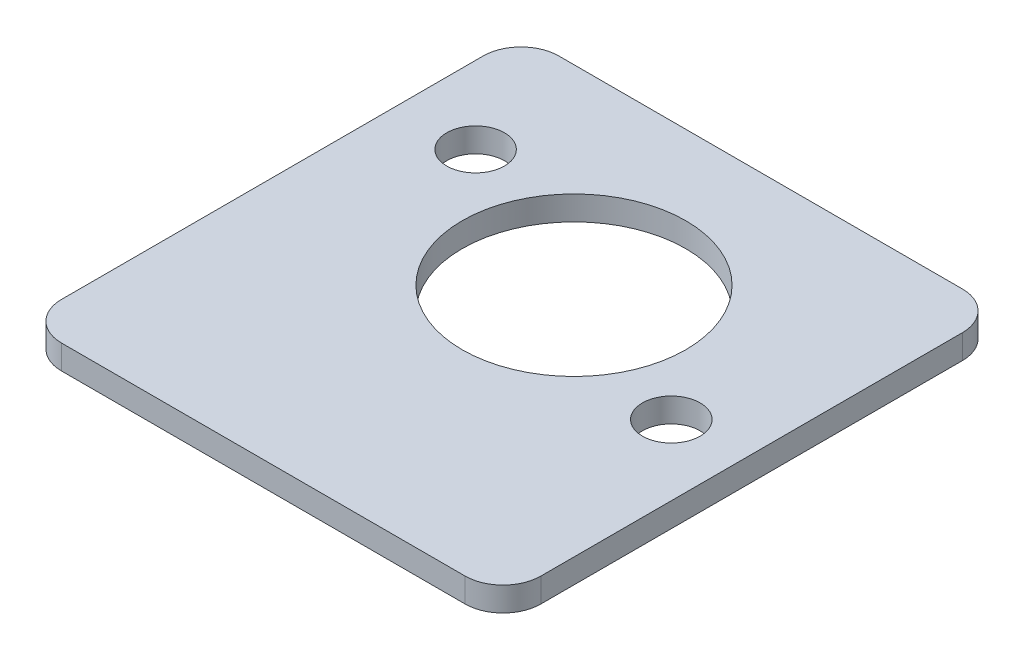
ISO-10303-21;
HEADER;
FILE_DESCRIPTION(('STEP AP214'),'2;1');
FILE_NAME('part.step','',(''),(''),'','','');
FILE_SCHEMA(('AUTOMOTIVE_DESIGN { 1 0 10303 214 1 1 1 1 }'));
ENDSEC;
DATA;
#1=APPLICATION_CONTEXT('core data for automotive mechanical design processes');
#2=APPLICATION_PROTOCOL_DEFINITION('international standard','automotive_design',2000,#1);
#3=PRODUCT_CONTEXT('',#1,'mechanical');
#4=PRODUCT('Part','Part','',(#3));
#5=PRODUCT_RELATED_PRODUCT_CATEGORY('part','',(#4));
#6=PRODUCT_DEFINITION_FORMATION('','',#4);
#7=PRODUCT_DEFINITION_CONTEXT('part definition',#1,'design');
#8=PRODUCT_DEFINITION('design','',#6,#7);
#9=PRODUCT_DEFINITION_SHAPE('','',#8);
#10=(LENGTH_UNIT() NAMED_UNIT(*) SI_UNIT(.MILLI.,.METRE.));
#11=(NAMED_UNIT(*) PLANE_ANGLE_UNIT() SI_UNIT($,.RADIAN.));
#12=(NAMED_UNIT(*) SI_UNIT($,.STERADIAN.) SOLID_ANGLE_UNIT());
#13=UNCERTAINTY_MEASURE_WITH_UNIT(LENGTH_MEASURE(1.E-05),#10,'distance_accuracy_value','');
#14=(GEOMETRIC_REPRESENTATION_CONTEXT(3) GLOBAL_UNCERTAINTY_ASSIGNED_CONTEXT((#13)) GLOBAL_UNIT_ASSIGNED_CONTEXT((#10,
#11,#12)) REPRESENTATION_CONTEXT('',''));
#15=CARTESIAN_POINT('',(0.,0.,0.));
#16=DIRECTION('',(0.,0.,1.));
#17=DIRECTION('',(1.,0.,0.));
#18=AXIS2_PLACEMENT_3D('',#15,#16,#17);
#19=CARTESIAN_POINT('',(0.,3.2,0.));
#20=DIRECTION('',(0.,1.,0.));
#21=DIRECTION('',(0.,0.,1.));
#22=AXIS2_PLACEMENT_3D('',#19,#20,#21);
#23=PLANE('',#22);
#24=CARTESIAN_POINT('',(-21.47,3.2,-16.66));
#25=DIRECTION('',(0.,1.,0.));
#26=DIRECTION('',(0.,0.,1.));
#27=AXIS2_PLACEMENT_3D('',#24,#25,#26);
#28=CIRCLE('',#27,3.81);
#29=CARTESIAN_POINT('',(-21.47,3.2,-12.85));
#30=VERTEX_POINT('',#29);
#31=EDGE_CURVE('E183',#30,#30,#28,.T.);
#32=ORIENTED_EDGE('',*,*,#31,.F.);
#33=EDGE_LOOP('',(#32));
#34=FACE_BOUND('',#33,.T.);
#35=CARTESIAN_POINT('',(0.569999999999994,3.2,-7.62000000000002));
#36=DIRECTION('',(0.,1.,0.));
#37=DIRECTION('',(0.,0.,1.));
#38=AXIS2_PLACEMENT_3D('',#35,#36,#37);
#39=CIRCLE('',#38,14.77);
#40=CARTESIAN_POINT('',(0.569999999999994,3.2,7.14999999999999));
#41=VERTEX_POINT('',#40);
#42=EDGE_CURVE('E138',#41,#41,#39,.T.);
#43=ORIENTED_EDGE('',*,*,#42,.F.);
#44=EDGE_LOOP('',(#43));
#45=FACE_BOUND('',#44,.T.);
#46=CARTESIAN_POINT('',(22.3659216527605,3.2,1.31988801002514));
#47=DIRECTION('',(0.,1.,0.));
#48=DIRECTION('',(0.,0.,1.));
#49=AXIS2_PLACEMENT_3D('',#46,#47,#48);
#50=CIRCLE('',#49,3.81);
#51=CARTESIAN_POINT('',(22.3659216527605,3.2,5.12988801002514));
#52=VERTEX_POINT('',#51);
#53=EDGE_CURVE('E176',#52,#52,#50,.T.);
#54=ORIENTED_EDGE('',*,*,#53,.F.);
#55=EDGE_LOOP('',(#54));
#56=FACE_BOUND('',#55,.T.);
#57=DIRECTION('',(-1.,0.,0.));
#58=VECTOR('',#57,1.);
#59=CARTESIAN_POINT('',(31.66,3.2,-32.85));
#60=LINE('',#59,#58);
#61=CARTESIAN_POINT('',(26.66,3.2,-32.85));
#62=VERTEX_POINT('',#61);
#63=CARTESIAN_POINT('',(-26.66,3.2,-32.85));
#64=VERTEX_POINT('',#63);
#65=EDGE_CURVE('E12',#62,#64,#60,.T.);
#66=ORIENTED_EDGE('',*,*,#65,.T.);
#67=CARTESIAN_POINT('',(-26.66,3.2,-27.85));
#68=DIRECTION('',(0.,1.,0.));
#69=DIRECTION('',(0.,0.,1.));
#70=AXIS2_PLACEMENT_3D('',#67,#68,#69);
#71=CIRCLE('',#70,5.);
#72=CARTESIAN_POINT('',(-31.66,3.2,-27.85));
#73=VERTEX_POINT('',#72);
#74=EDGE_CURVE('E102',#64,#73,#71,.T.);
#75=ORIENTED_EDGE('',*,*,#74,.T.);
#76=DIRECTION('',(0.,0.,1.));
#77=VECTOR('',#76,1.);
#78=CARTESIAN_POINT('',(-31.66,3.2,32.85));
#79=LINE('',#78,#77);
#80=CARTESIAN_POINT('',(-31.66,3.2,27.85));
#81=VERTEX_POINT('',#80);
#82=EDGE_CURVE('E116',#73,#81,#79,.T.);
#83=ORIENTED_EDGE('',*,*,#82,.T.);
#84=CARTESIAN_POINT('',(-26.66,3.2,27.85));
#85=DIRECTION('',(0.,1.,0.));
#86=DIRECTION('',(0.,0.,-1.));
#87=AXIS2_PLACEMENT_3D('',#84,#85,#86);
#88=CIRCLE('',#87,5.);
#89=CARTESIAN_POINT('',(-26.66,3.2,32.85));
#90=VERTEX_POINT('',#89);
#91=EDGE_CURVE('E119',#81,#90,#88,.T.);
#92=ORIENTED_EDGE('',*,*,#91,.T.);
#93=DIRECTION('',(1.,0.,0.));
#94=VECTOR('',#93,1.);
#95=CARTESIAN_POINT('',(31.66,3.2,32.85));
#96=LINE('',#95,#94);
#97=CARTESIAN_POINT('',(26.66,3.2,32.85));
#98=VERTEX_POINT('',#97);
#99=EDGE_CURVE('E123',#90,#98,#96,.T.);
#100=ORIENTED_EDGE('',*,*,#99,.T.);
#101=CARTESIAN_POINT('',(26.66,3.2,27.85));
#102=DIRECTION('',(0.,1.,0.));
#103=DIRECTION('',(0.,0.,1.));
#104=AXIS2_PLACEMENT_3D('',#101,#102,#103);
#105=CIRCLE('',#104,5.);
#106=CARTESIAN_POINT('',(31.66,3.2,27.85));
#107=VERTEX_POINT('',#106);
#108=EDGE_CURVE('E163',#98,#107,#105,.T.);
#109=ORIENTED_EDGE('',*,*,#108,.T.);
#110=DIRECTION('',(0.,0.,-1.));
#111=VECTOR('',#110,1.);
#112=CARTESIAN_POINT('',(31.66,3.2,32.85));
#113=LINE('',#112,#111);
#114=CARTESIAN_POINT('',(31.66,3.2,-27.85));
#115=VERTEX_POINT('',#114);
#116=EDGE_CURVE('E42',#107,#115,#113,.T.);
#117=ORIENTED_EDGE('',*,*,#116,.T.);
#118=CARTESIAN_POINT('',(26.66,3.2,-27.85));
#119=DIRECTION('',(0.,1.,0.));
#120=DIRECTION('',(0.,0.,1.));
#121=AXIS2_PLACEMENT_3D('',#118,#119,#120);
#122=CIRCLE('',#121,5.);
#123=EDGE_CURVE('E120',#115,#62,#122,.T.);
#124=ORIENTED_EDGE('',*,*,#123,.T.);
#125=EDGE_LOOP('',(#66,#75,#83,#92,#100,#109,#117,#124));
#126=FACE_BOUND('',#125,.T.);
#127=ADVANCED_FACE('F33',(#34,#45,#56,#126),#23,.T.);
#128=CARTESIAN_POINT('',(0.,0.,0.));
#129=DIRECTION('',(0.,1.,0.));
#130=DIRECTION('',(0.,0.,1.));
#131=AXIS2_PLACEMENT_3D('',#128,#129,#130);
#132=PLANE('',#131);
#133=CARTESIAN_POINT('',(0.569999999999994,0.,-7.62000000000002));
#134=DIRECTION('',(0.,1.,0.));
#135=DIRECTION('',(0.,0.,1.));
#136=AXIS2_PLACEMENT_3D('',#133,#134,#135);
#137=CIRCLE('',#136,14.77);
#138=CARTESIAN_POINT('',(0.569999999999994,0.,7.14999999999999));
#139=VERTEX_POINT('',#138);
#140=EDGE_CURVE('E130',#139,#139,#137,.T.);
#141=ORIENTED_EDGE('',*,*,#140,.T.);
#142=EDGE_LOOP('',(#141));
#143=FACE_BOUND('',#142,.T.);
#144=CARTESIAN_POINT('',(-21.47,0.,-16.66));
#145=DIRECTION('',(0.,1.,0.));
#146=DIRECTION('',(0.,0.,1.));
#147=AXIS2_PLACEMENT_3D('',#144,#145,#146);
#148=CIRCLE('',#147,3.81);
#149=CARTESIAN_POINT('',(-21.47,0.,-12.85));
#150=VERTEX_POINT('',#149);
#151=EDGE_CURVE('E179',#150,#150,#148,.T.);
#152=ORIENTED_EDGE('',*,*,#151,.T.);
#153=EDGE_LOOP('',(#152));
#154=FACE_BOUND('',#153,.T.);
#155=CARTESIAN_POINT('',(22.3659216527605,0.,1.31988801002514));
#156=DIRECTION('',(0.,1.,0.));
#157=DIRECTION('',(0.,0.,1.));
#158=AXIS2_PLACEMENT_3D('',#155,#156,#157);
#159=CIRCLE('',#158,3.81);
#160=CARTESIAN_POINT('',(22.3659216527605,0.,5.12988801002514));
#161=VERTEX_POINT('',#160);
#162=EDGE_CURVE('E180',#161,#161,#159,.T.);
#163=ORIENTED_EDGE('',*,*,#162,.T.);
#164=EDGE_LOOP('',(#163));
#165=FACE_BOUND('',#164,.T.);
#166=CARTESIAN_POINT('',(-26.66,0.,-27.85));
#167=DIRECTION('',(0.,1.,0.));
#168=DIRECTION('',(0.,0.,1.));
#169=AXIS2_PLACEMENT_3D('',#166,#167,#168);
#170=CIRCLE('',#169,5.);
#171=CARTESIAN_POINT('',(-31.66,0.,-27.85));
#172=VERTEX_POINT('',#171);
#173=CARTESIAN_POINT('',(-26.66,0.,-32.85));
#174=VERTEX_POINT('',#173);
#175=EDGE_CURVE('E105',#172,#174,#170,.F.);
#176=ORIENTED_EDGE('',*,*,#175,.T.);
#177=DIRECTION('',(-1.,0.,0.));
#178=VECTOR('',#177,1.);
#179=CARTESIAN_POINT('',(31.66,0.,-32.85));
#180=LINE('',#179,#178);
#181=CARTESIAN_POINT('',(26.66,0.,-32.85));
#182=VERTEX_POINT('',#181);
#183=EDGE_CURVE('E37',#182,#174,#180,.T.);
#184=ORIENTED_EDGE('',*,*,#183,.F.);
#185=CARTESIAN_POINT('',(26.66,0.,-27.85));
#186=DIRECTION('',(0.,1.,0.));
#187=DIRECTION('',(0.,0.,1.));
#188=AXIS2_PLACEMENT_3D('',#185,#186,#187);
#189=CIRCLE('',#188,5.);
#190=CARTESIAN_POINT('',(31.66,0.,-27.85));
#191=VERTEX_POINT('',#190);
#192=EDGE_CURVE('E153',#182,#191,#189,.F.);
#193=ORIENTED_EDGE('',*,*,#192,.T.);
#194=DIRECTION('',(0.,0.,-1.));
#195=VECTOR('',#194,1.);
#196=CARTESIAN_POINT('',(31.66,0.,32.85));
#197=LINE('',#196,#195);
#198=CARTESIAN_POINT('',(31.66,0.,27.85));
#199=VERTEX_POINT('',#198);
#200=EDGE_CURVE('E128',#199,#191,#197,.T.);
#201=ORIENTED_EDGE('',*,*,#200,.F.);
#202=CARTESIAN_POINT('',(26.66,0.,27.85));
#203=DIRECTION('',(0.,1.,0.));
#204=DIRECTION('',(0.,0.,1.));
#205=AXIS2_PLACEMENT_3D('',#202,#203,#204);
#206=CIRCLE('',#205,5.);
#207=CARTESIAN_POINT('',(26.66,0.,32.85));
#208=VERTEX_POINT('',#207);
#209=EDGE_CURVE('E58',#199,#208,#206,.F.);
#210=ORIENTED_EDGE('',*,*,#209,.T.);
#211=DIRECTION('',(1.,0.,0.));
#212=VECTOR('',#211,1.);
#213=CARTESIAN_POINT('',(31.66,0.,32.85));
#214=LINE('',#213,#212);
#215=CARTESIAN_POINT('',(-26.66,0.,32.85));
#216=VERTEX_POINT('',#215);
#217=EDGE_CURVE('E137',#216,#208,#214,.T.);
#218=ORIENTED_EDGE('',*,*,#217,.F.);
#219=CARTESIAN_POINT('',(-26.66,0.,27.85));
#220=DIRECTION('',(0.,1.,0.));
#221=DIRECTION('',(0.,0.,1.));
#222=AXIS2_PLACEMENT_3D('',#219,#220,#221);
#223=CIRCLE('',#222,5.);
#224=CARTESIAN_POINT('',(-31.66,0.,27.85));
#225=VERTEX_POINT('',#224);
#226=EDGE_CURVE('E50',#216,#225,#223,.F.);
#227=ORIENTED_EDGE('',*,*,#226,.T.);
#228=DIRECTION('',(0.,0.,1.));
#229=VECTOR('',#228,1.);
#230=CARTESIAN_POINT('',(-31.66,0.,32.85));
#231=LINE('',#230,#229);
#232=EDGE_CURVE('E135',#172,#225,#231,.T.);
#233=ORIENTED_EDGE('',*,*,#232,.F.);
#234=EDGE_LOOP('',(#176,#184,#193,#201,#210,#218,#227,#233));
#235=FACE_BOUND('',#234,.T.);
#236=ADVANCED_FACE('F150',(#143,#154,#165,#235),#132,.F.);
#237=CARTESIAN_POINT('',(-31.66,3.2,32.85));
#238=DIRECTION('',(1.,0.,0.));
#239=DIRECTION('',(0.,0.,-1.));
#240=AXIS2_PLACEMENT_3D('',#237,#238,#239);
#241=PLANE('',#240);
#242=DIRECTION('',(0.,1.,0.));
#243=VECTOR('',#242,1.);
#244=CARTESIAN_POINT('',(-31.66,-92.1589021160734,-27.85));
#245=LINE('',#244,#243);
#246=EDGE_CURVE('E99',#172,#73,#245,.T.);
#247=ORIENTED_EDGE('',*,*,#246,.F.);
#248=ORIENTED_EDGE('',*,*,#232,.T.);
#249=DIRECTION('',(0.,1.,0.));
#250=VECTOR('',#249,1.);
#251=CARTESIAN_POINT('',(-31.66,-92.1589021160734,27.85));
#252=LINE('',#251,#250);
#253=EDGE_CURVE('E110',#225,#81,#252,.T.);
#254=ORIENTED_EDGE('',*,*,#253,.T.);
#255=ORIENTED_EDGE('',*,*,#82,.F.);
#256=EDGE_LOOP('',(#247,#248,#254,#255));
#257=FACE_BOUND('',#256,.T.);
#258=ADVANCED_FACE('F35',(#257),#241,.F.);
#259=CARTESIAN_POINT('',(31.66,3.2,32.85));
#260=DIRECTION('',(0.,0.,-1.));
#261=DIRECTION('',(-1.,0.,0.));
#262=AXIS2_PLACEMENT_3D('',#259,#260,#261);
#263=PLANE('',#262);
#264=DIRECTION('',(0.,1.,0.));
#265=VECTOR('',#264,1.);
#266=CARTESIAN_POINT('',(-26.66,-92.1589021160734,32.85));
#267=LINE('',#266,#265);
#268=EDGE_CURVE('E171',#216,#90,#267,.T.);
#269=ORIENTED_EDGE('',*,*,#268,.F.);
#270=ORIENTED_EDGE('',*,*,#217,.T.);
#271=DIRECTION('',(0.,1.,0.));
#272=VECTOR('',#271,1.);
#273=CARTESIAN_POINT('',(26.66,-92.1589021160734,32.85));
#274=LINE('',#273,#272);
#275=EDGE_CURVE('E168',#208,#98,#274,.T.);
#276=ORIENTED_EDGE('',*,*,#275,.T.);
#277=ORIENTED_EDGE('',*,*,#99,.F.);
#278=EDGE_LOOP('',(#269,#270,#276,#277));
#279=FACE_BOUND('',#278,.T.);
#280=ADVANCED_FACE('F220',(#279),#263,.F.);
#281=CARTESIAN_POINT('',(31.66,3.2,32.85));
#282=DIRECTION('',(-1.,0.,0.));
#283=DIRECTION('',(0.,0.,1.));
#284=AXIS2_PLACEMENT_3D('',#281,#282,#283);
#285=PLANE('',#284);
#286=DIRECTION('',(0.,1.,0.));
#287=VECTOR('',#286,1.);
#288=CARTESIAN_POINT('',(31.66,-92.1589021160734,27.85));
#289=LINE('',#288,#287);
#290=EDGE_CURVE('E147',#199,#107,#289,.T.);
#291=ORIENTED_EDGE('',*,*,#290,.F.);
#292=ORIENTED_EDGE('',*,*,#200,.T.);
#293=DIRECTION('',(0.,1.,0.));
#294=VECTOR('',#293,1.);
#295=CARTESIAN_POINT('',(31.66,-92.1589021160734,-27.85));
#296=LINE('',#295,#294);
#297=EDGE_CURVE('E146',#191,#115,#296,.T.);
#298=ORIENTED_EDGE('',*,*,#297,.T.);
#299=ORIENTED_EDGE('',*,*,#116,.F.);
#300=EDGE_LOOP('',(#291,#292,#298,#299));
#301=FACE_BOUND('',#300,.T.);
#302=ADVANCED_FACE('F144',(#301),#285,.F.);
#303=CARTESIAN_POINT('',(31.66,3.2,-32.85));
#304=DIRECTION('',(0.,0.,1.));
#305=DIRECTION('',(1.,0.,0.));
#306=AXIS2_PLACEMENT_3D('',#303,#304,#305);
#307=PLANE('',#306);
#308=ORIENTED_EDGE('',*,*,#183,.T.);
#309=DIRECTION('',(0.,1.,0.));
#310=VECTOR('',#309,1.);
#311=CARTESIAN_POINT('',(-26.66,-92.1589021160734,-32.85));
#312=LINE('',#311,#310);
#313=EDGE_CURVE('E111',#174,#64,#312,.T.);
#314=ORIENTED_EDGE('',*,*,#313,.T.);
#315=ORIENTED_EDGE('',*,*,#65,.F.);
#316=DIRECTION('',(0.,1.,0.));
#317=VECTOR('',#316,1.);
#318=CARTESIAN_POINT('',(26.66,-92.1589021160734,-32.85));
#319=LINE('',#318,#317);
#320=EDGE_CURVE('E165',#182,#62,#319,.T.);
#321=ORIENTED_EDGE('',*,*,#320,.F.);
#322=EDGE_LOOP('',(#308,#314,#315,#321));
#323=FACE_BOUND('',#322,.T.);
#324=ADVANCED_FACE('F198',(#323),#307,.F.);
#325=CARTESIAN_POINT('',(0.569999999999994,3.2,-7.62000000000002));
#326=DIRECTION('',(0.,-1.,0.));
#327=DIRECTION('',(0.,0.,-1.));
#328=AXIS2_PLACEMENT_3D('',#325,#326,#327);
#329=CYLINDRICAL_SURFACE('',#328,14.77);
#330=ORIENTED_EDGE('',*,*,#42,.T.);
#331=EDGE_LOOP('',(#330));
#332=FACE_BOUND('',#331,.T.);
#333=ORIENTED_EDGE('',*,*,#140,.F.);
#334=EDGE_LOOP('',(#333));
#335=FACE_BOUND('',#334,.T.);
#336=ADVANCED_FACE('F195',(#332,#335),#329,.F.);
#337=CARTESIAN_POINT('',(-21.47,3.2,-16.66));
#338=DIRECTION('',(0.,-1.,0.));
#339=DIRECTION('',(0.,0.,-1.));
#340=AXIS2_PLACEMENT_3D('',#337,#338,#339);
#341=CYLINDRICAL_SURFACE('',#340,3.81);
#342=ORIENTED_EDGE('',*,*,#31,.T.);
#343=EDGE_LOOP('',(#342));
#344=FACE_BOUND('',#343,.T.);
#345=ORIENTED_EDGE('',*,*,#151,.F.);
#346=EDGE_LOOP('',(#345));
#347=FACE_BOUND('',#346,.T.);
#348=ADVANCED_FACE('F197',(#344,#347),#341,.F.);
#349=CARTESIAN_POINT('',(22.3659216527605,3.2,1.31988801002514));
#350=DIRECTION('',(0.,-1.,0.));
#351=DIRECTION('',(0.,0.,-1.));
#352=AXIS2_PLACEMENT_3D('',#349,#350,#351);
#353=CYLINDRICAL_SURFACE('',#352,3.81);
#354=ORIENTED_EDGE('',*,*,#53,.T.);
#355=EDGE_LOOP('',(#354));
#356=FACE_BOUND('',#355,.T.);
#357=ORIENTED_EDGE('',*,*,#162,.F.);
#358=EDGE_LOOP('',(#357));
#359=FACE_BOUND('',#358,.T.);
#360=ADVANCED_FACE('F204',(#356,#359),#353,.F.);
#361=CARTESIAN_POINT('',(26.66,-92.1589021160734,-27.85));
#362=DIRECTION('',(0.,1.,0.));
#363=DIRECTION('',(0.,0.,1.));
#364=AXIS2_PLACEMENT_3D('',#361,#362,#363);
#365=CYLINDRICAL_SURFACE('',#364,5.);
#366=ORIENTED_EDGE('',*,*,#320,.T.);
#367=ORIENTED_EDGE('',*,*,#123,.F.);
#368=ORIENTED_EDGE('',*,*,#297,.F.);
#369=ORIENTED_EDGE('',*,*,#192,.F.);
#370=EDGE_LOOP('',(#366,#367,#368,#369));
#371=FACE_BOUND('',#370,.T.);
#372=ADVANCED_FACE('F228',(#371),#365,.T.);
#373=CARTESIAN_POINT('',(-26.66,-92.1589021160734,-27.85));
#374=DIRECTION('',(0.,1.,0.));
#375=DIRECTION('',(0.,0.,1.));
#376=AXIS2_PLACEMENT_3D('',#373,#374,#375);
#377=CYLINDRICAL_SURFACE('',#376,5.);
#378=ORIENTED_EDGE('',*,*,#246,.T.);
#379=ORIENTED_EDGE('',*,*,#74,.F.);
#380=ORIENTED_EDGE('',*,*,#313,.F.);
#381=ORIENTED_EDGE('',*,*,#175,.F.);
#382=EDGE_LOOP('',(#378,#379,#380,#381));
#383=FACE_BOUND('',#382,.T.);
#384=ADVANCED_FACE('F101',(#383),#377,.T.);
#385=CARTESIAN_POINT('',(26.66,-92.1589021160734,27.85));
#386=DIRECTION('',(0.,1.,0.));
#387=DIRECTION('',(0.,0.,1.));
#388=AXIS2_PLACEMENT_3D('',#385,#386,#387);
#389=CYLINDRICAL_SURFACE('',#388,5.);
#390=ORIENTED_EDGE('',*,*,#290,.T.);
#391=ORIENTED_EDGE('',*,*,#108,.F.);
#392=ORIENTED_EDGE('',*,*,#275,.F.);
#393=ORIENTED_EDGE('',*,*,#209,.F.);
#394=EDGE_LOOP('',(#390,#391,#392,#393));
#395=FACE_BOUND('',#394,.T.);
#396=ADVANCED_FACE('F229',(#395),#389,.T.);
#397=CARTESIAN_POINT('',(-26.66,-92.1589021160734,27.85));
#398=DIRECTION('',(0.,1.,0.));
#399=DIRECTION('',(0.,0.,1.));
#400=AXIS2_PLACEMENT_3D('',#397,#398,#399);
#401=CYLINDRICAL_SURFACE('',#400,5.);
#402=ORIENTED_EDGE('',*,*,#268,.T.);
#403=ORIENTED_EDGE('',*,*,#91,.F.);
#404=ORIENTED_EDGE('',*,*,#253,.F.);
#405=ORIENTED_EDGE('',*,*,#226,.F.);
#406=EDGE_LOOP('',(#402,#403,#404,#405));
#407=FACE_BOUND('',#406,.T.);
#408=ADVANCED_FACE('F231',(#407),#401,.T.);
#409=CLOSED_SHELL('',(#127,#236,#258,#280,#302,#324,#336,#348,#360,#372,#384,#396,#408));
#410=MANIFOLD_SOLID_BREP('B2',#409);
#411=ADVANCED_BREP_SHAPE_REPRESENTATION('',(#18,#410),#14);
#412=SHAPE_DEFINITION_REPRESENTATION(#9,#411);
ENDSEC;
END-ISO-10303-21;
